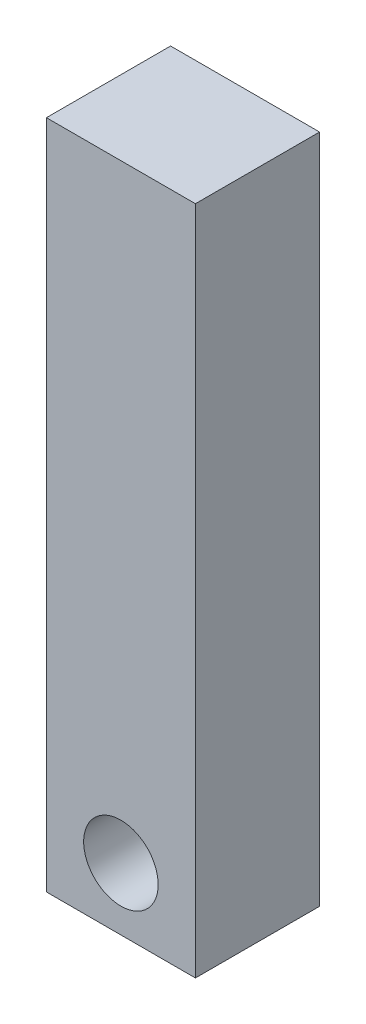
ISO-10303-21;
HEADER;
FILE_DESCRIPTION(('STEP AP214'),'2;1');
FILE_NAME('part.step','',(''),(''),'','','');
FILE_SCHEMA(('AUTOMOTIVE_DESIGN { 1 0 10303 214 1 1 1 1 }'));
ENDSEC;
DATA;
#1=APPLICATION_CONTEXT('core data for automotive mechanical design processes');
#2=APPLICATION_PROTOCOL_DEFINITION('international standard','automotive_design',2000,#1);
#3=PRODUCT_CONTEXT('',#1,'mechanical');
#4=PRODUCT('Part','Part','',(#3));
#5=PRODUCT_RELATED_PRODUCT_CATEGORY('part','',(#4));
#6=PRODUCT_DEFINITION_FORMATION('','',#4);
#7=PRODUCT_DEFINITION_CONTEXT('part definition',#1,'design');
#8=PRODUCT_DEFINITION('design','',#6,#7);
#9=PRODUCT_DEFINITION_SHAPE('','',#8);
#10=(LENGTH_UNIT() NAMED_UNIT(*) SI_UNIT(.MILLI.,.METRE.));
#11=(NAMED_UNIT(*) PLANE_ANGLE_UNIT() SI_UNIT($,.RADIAN.));
#12=(NAMED_UNIT(*) SI_UNIT($,.STERADIAN.) SOLID_ANGLE_UNIT());
#13=UNCERTAINTY_MEASURE_WITH_UNIT(LENGTH_MEASURE(1.E-05),#10,'distance_accuracy_value','');
#14=(GEOMETRIC_REPRESENTATION_CONTEXT(3) GLOBAL_UNCERTAINTY_ASSIGNED_CONTEXT((#13)) GLOBAL_UNIT_ASSIGNED_CONTEXT((#10,
#11,#12)) REPRESENTATION_CONTEXT('',''));
#15=CARTESIAN_POINT('',(0.,0.,0.));
#16=DIRECTION('',(0.,0.,1.));
#17=DIRECTION('',(1.,0.,0.));
#18=AXIS2_PLACEMENT_3D('',#15,#16,#17);
#19=CARTESIAN_POINT('',(-12.,-54.01,10.));
#20=DIRECTION('',(1.,0.,0.));
#21=DIRECTION('',(0.,0.,-1.));
#22=AXIS2_PLACEMENT_3D('',#19,#20,#21);
#23=PLANE('',#22);
#24=DIRECTION('',(0.,-1.,0.));
#25=VECTOR('',#24,1.);
#26=CARTESIAN_POINT('',(-12.,-54.01,0.));
#27=LINE('',#26,#25);
#28=CARTESIAN_POINT('',(-12.,0.,0.));
#29=VERTEX_POINT('',#28);
#30=CARTESIAN_POINT('',(-12.,-54.01,0.));
#31=VERTEX_POINT('',#30);
#32=EDGE_CURVE('E107',#29,#31,#27,.T.);
#33=ORIENTED_EDGE('',*,*,#32,.T.);
#34=DIRECTION('',(0.,0.,-1.));
#35=VECTOR('',#34,1.);
#36=CARTESIAN_POINT('',(-12.,-54.01,10.));
#37=LINE('',#36,#35);
#38=CARTESIAN_POINT('',(-12.,-54.01,10.));
#39=VERTEX_POINT('',#38);
#40=EDGE_CURVE('E13',#39,#31,#37,.T.);
#41=ORIENTED_EDGE('',*,*,#40,.F.);
#42=DIRECTION('',(0.,-1.,0.));
#43=VECTOR('',#42,1.);
#44=CARTESIAN_POINT('',(-12.,-54.01,10.));
#45=LINE('',#44,#43);
#46=CARTESIAN_POINT('',(-12.,0.,10.));
#47=VERTEX_POINT('',#46);
#48=EDGE_CURVE('E95',#47,#39,#45,.T.);
#49=ORIENTED_EDGE('',*,*,#48,.F.);
#50=DIRECTION('',(0.,0.,-1.));
#51=VECTOR('',#50,1.);
#52=CARTESIAN_POINT('',(-12.,0.,10.));
#53=LINE('',#52,#51);
#54=EDGE_CURVE('E103',#47,#29,#53,.T.);
#55=ORIENTED_EDGE('',*,*,#54,.T.);
#56=EDGE_LOOP('',(#33,#41,#49,#55));
#57=FACE_BOUND('',#56,.T.);
#58=ADVANCED_FACE('F44',(#57),#23,.F.);
#59=CARTESIAN_POINT('',(-12.,-54.01,10.));
#60=DIRECTION('',(0.,1.,0.));
#61=DIRECTION('',(0.,0.,1.));
#62=AXIS2_PLACEMENT_3D('',#59,#60,#61);
#63=PLANE('',#62);
#64=DIRECTION('',(1.,0.,0.));
#65=VECTOR('',#64,1.);
#66=CARTESIAN_POINT('',(-12.,-54.01,0.));
#67=LINE('',#66,#65);
#68=CARTESIAN_POINT('',(0.,-54.01,0.));
#69=VERTEX_POINT('',#68);
#70=EDGE_CURVE('E99',#31,#69,#67,.T.);
#71=ORIENTED_EDGE('',*,*,#70,.T.);
#72=DIRECTION('',(0.,0.,-1.));
#73=VECTOR('',#72,1.);
#74=CARTESIAN_POINT('',(0.,-54.01,10.));
#75=LINE('',#74,#73);
#76=CARTESIAN_POINT('',(0.,-54.01,10.));
#77=VERTEX_POINT('',#76);
#78=EDGE_CURVE('E52',#77,#69,#75,.T.);
#79=ORIENTED_EDGE('',*,*,#78,.F.);
#80=DIRECTION('',(1.,0.,0.));
#81=VECTOR('',#80,1.);
#82=CARTESIAN_POINT('',(-12.,-54.01,10.));
#83=LINE('',#82,#81);
#84=EDGE_CURVE('E90',#39,#77,#83,.T.);
#85=ORIENTED_EDGE('',*,*,#84,.F.);
#86=ORIENTED_EDGE('',*,*,#40,.T.);
#87=EDGE_LOOP('',(#71,#79,#85,#86));
#88=FACE_BOUND('',#87,.T.);
#89=ADVANCED_FACE('F98',(#88),#63,.F.);
#90=CARTESIAN_POINT('',(0.,-54.01,10.));
#91=DIRECTION('',(-1.,0.,0.));
#92=DIRECTION('',(0.,0.,1.));
#93=AXIS2_PLACEMENT_3D('',#90,#91,#92);
#94=PLANE('',#93);
#95=DIRECTION('',(0.,1.,0.));
#96=VECTOR('',#95,1.);
#97=CARTESIAN_POINT('',(0.,-54.01,0.));
#98=LINE('',#97,#96);
#99=CARTESIAN_POINT('',(0.,0.,0.));
#100=VERTEX_POINT('',#99);
#101=EDGE_CURVE('E77',#69,#100,#98,.T.);
#102=ORIENTED_EDGE('',*,*,#101,.T.);
#103=DIRECTION('',(0.,0.,-1.));
#104=VECTOR('',#103,1.);
#105=CARTESIAN_POINT('',(0.,0.,10.));
#106=LINE('',#105,#104);
#107=CARTESIAN_POINT('',(0.,0.,10.));
#108=VERTEX_POINT('',#107);
#109=EDGE_CURVE('E100',#108,#100,#106,.T.);
#110=ORIENTED_EDGE('',*,*,#109,.F.);
#111=DIRECTION('',(0.,1.,0.));
#112=VECTOR('',#111,1.);
#113=CARTESIAN_POINT('',(0.,-54.01,10.));
#114=LINE('',#113,#112);
#115=EDGE_CURVE('E93',#77,#108,#114,.T.);
#116=ORIENTED_EDGE('',*,*,#115,.F.);
#117=ORIENTED_EDGE('',*,*,#78,.T.);
#118=EDGE_LOOP('',(#102,#110,#116,#117));
#119=FACE_BOUND('',#118,.T.);
#120=ADVANCED_FACE('F101',(#119),#94,.F.);
#121=CARTESIAN_POINT('',(-12.,0.,10.));
#122=DIRECTION('',(0.,-1.,0.));
#123=DIRECTION('',(0.,0.,-1.));
#124=AXIS2_PLACEMENT_3D('',#121,#122,#123);
#125=PLANE('',#124);
#126=DIRECTION('',(-1.,0.,0.));
#127=VECTOR('',#126,1.);
#128=CARTESIAN_POINT('',(-12.,0.,0.));
#129=LINE('',#128,#127);
#130=EDGE_CURVE('E83',#100,#29,#129,.T.);
#131=ORIENTED_EDGE('',*,*,#130,.T.);
#132=ORIENTED_EDGE('',*,*,#54,.F.);
#133=DIRECTION('',(-1.,0.,0.));
#134=VECTOR('',#133,1.);
#135=CARTESIAN_POINT('',(-12.,0.,10.));
#136=LINE('',#135,#134);
#137=EDGE_CURVE('E60',#108,#47,#136,.T.);
#138=ORIENTED_EDGE('',*,*,#137,.F.);
#139=ORIENTED_EDGE('',*,*,#109,.T.);
#140=EDGE_LOOP('',(#131,#132,#138,#139));
#141=FACE_BOUND('',#140,.T.);
#142=ADVANCED_FACE('F115',(#141),#125,.F.);
#143=CARTESIAN_POINT('',(0.,0.,10.));
#144=DIRECTION('',(0.,0.,-1.));
#145=DIRECTION('',(-1.,0.,0.));
#146=AXIS2_PLACEMENT_3D('',#143,#144,#145);
#147=PLANE('',#146);
#148=CARTESIAN_POINT('',(-6.,-49.0000000000001,10.));
#149=DIRECTION('',(0.,0.,1.));
#150=DIRECTION('',(1.,0.,0.));
#151=AXIS2_PLACEMENT_3D('',#148,#149,#150);
#152=CIRCLE('',#151,3.);
#153=CARTESIAN_POINT('',(-2.99999999999999,-49.0000000000001,10.));
#154=VERTEX_POINT('',#153);
#155=EDGE_CURVE('E121',#154,#154,#152,.T.);
#156=ORIENTED_EDGE('',*,*,#155,.F.);
#157=EDGE_LOOP('',(#156));
#158=FACE_BOUND('',#157,.T.);
#159=ORIENTED_EDGE('',*,*,#48,.T.);
#160=ORIENTED_EDGE('',*,*,#84,.T.);
#161=ORIENTED_EDGE('',*,*,#115,.T.);
#162=ORIENTED_EDGE('',*,*,#137,.T.);
#163=EDGE_LOOP('',(#159,#160,#161,#162));
#164=FACE_BOUND('',#163,.T.);
#165=ADVANCED_FACE('F91',(#158,#164),#147,.F.);
#166=CARTESIAN_POINT('',(0.,0.,0.));
#167=DIRECTION('',(0.,0.,-1.));
#168=DIRECTION('',(-1.,0.,0.));
#169=AXIS2_PLACEMENT_3D('',#166,#167,#168);
#170=PLANE('',#169);
#171=CARTESIAN_POINT('',(-6.,-49.0000000000001,0.));
#172=DIRECTION('',(0.,0.,1.));
#173=DIRECTION('',(1.,0.,0.));
#174=AXIS2_PLACEMENT_3D('',#171,#172,#173);
#175=CIRCLE('',#174,3.);
#176=CARTESIAN_POINT('',(-2.99999999999999,-49.0000000000001,0.));
#177=VERTEX_POINT('',#176);
#178=EDGE_CURVE('E110',#177,#177,#175,.T.);
#179=ORIENTED_EDGE('',*,*,#178,.T.);
#180=EDGE_LOOP('',(#179));
#181=FACE_BOUND('',#180,.T.);
#182=ORIENTED_EDGE('',*,*,#32,.F.);
#183=ORIENTED_EDGE('',*,*,#130,.F.);
#184=ORIENTED_EDGE('',*,*,#101,.F.);
#185=ORIENTED_EDGE('',*,*,#70,.F.);
#186=EDGE_LOOP('',(#182,#183,#184,#185));
#187=FACE_BOUND('',#186,.T.);
#188=ADVANCED_FACE('F118',(#181,#187),#170,.T.);
#189=CARTESIAN_POINT('',(-6.,-49.0000000000001,0.));
#190=DIRECTION('',(0.,0.,1.));
#191=DIRECTION('',(1.,0.,0.));
#192=AXIS2_PLACEMENT_3D('',#189,#190,#191);
#193=CYLINDRICAL_SURFACE('',#192,3.);
#194=ORIENTED_EDGE('',*,*,#178,.F.);
#195=EDGE_LOOP('',(#194));
#196=FACE_BOUND('',#195,.T.);
#197=ORIENTED_EDGE('',*,*,#155,.T.);
#198=EDGE_LOOP('',(#197));
#199=FACE_BOUND('',#198,.T.);
#200=ADVANCED_FACE('F128',(#196,#199),#193,.F.);
#201=CLOSED_SHELL('',(#58,#89,#120,#142,#165,#188,#200));
#202=MANIFOLD_SOLID_BREP('B2',#201);
#203=ADVANCED_BREP_SHAPE_REPRESENTATION('',(#18,#202),#14);
#204=SHAPE_DEFINITION_REPRESENTATION(#9,#203);
ENDSEC;
END-ISO-10303-21;
